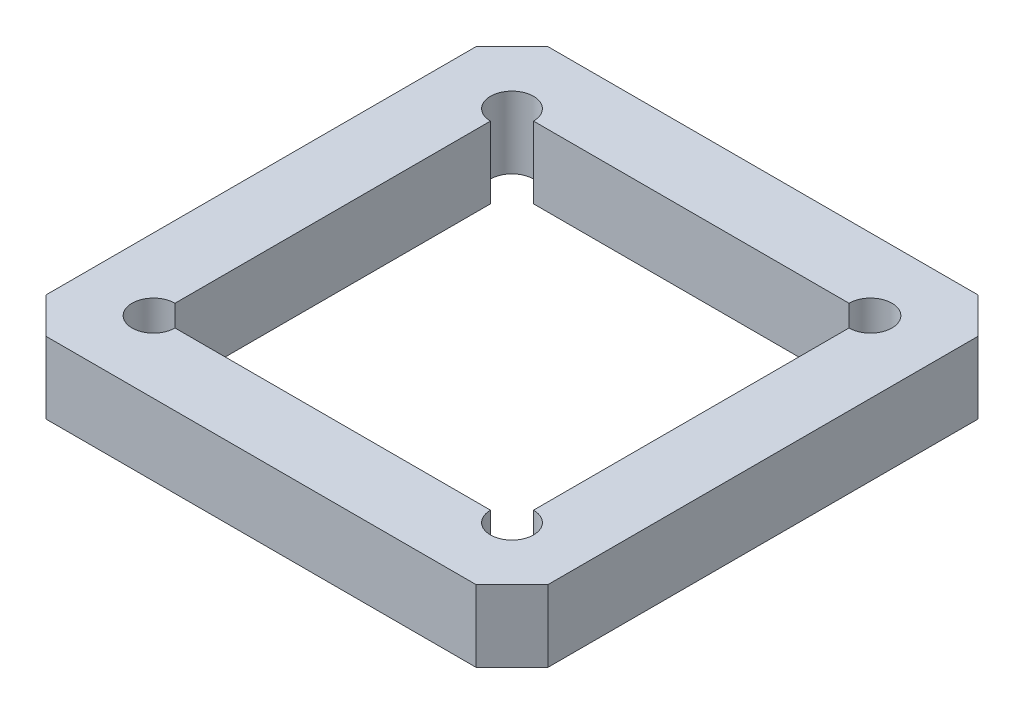
ISO-10303-21;
HEADER;
FILE_DESCRIPTION(('STEP AP214'),'2;1');
FILE_NAME('part.step','',(''),(''),'','','');
FILE_SCHEMA(('AUTOMOTIVE_DESIGN { 1 0 10303 214 1 1 1 1 }'));
ENDSEC;
DATA;
#1=APPLICATION_CONTEXT('core data for automotive mechanical design processes');
#2=APPLICATION_PROTOCOL_DEFINITION('international standard','automotive_design',2000,#1);
#3=PRODUCT_CONTEXT('',#1,'mechanical');
#4=PRODUCT('Part','Part','',(#3));
#5=PRODUCT_RELATED_PRODUCT_CATEGORY('part','',(#4));
#6=PRODUCT_DEFINITION_FORMATION('','',#4);
#7=PRODUCT_DEFINITION_CONTEXT('part definition',#1,'design');
#8=PRODUCT_DEFINITION('design','',#6,#7);
#9=PRODUCT_DEFINITION_SHAPE('','',#8);
#10=(LENGTH_UNIT() NAMED_UNIT(*) SI_UNIT(.MILLI.,.METRE.));
#11=(NAMED_UNIT(*) PLANE_ANGLE_UNIT() SI_UNIT($,.RADIAN.));
#12=(NAMED_UNIT(*) SI_UNIT($,.STERADIAN.) SOLID_ANGLE_UNIT());
#13=UNCERTAINTY_MEASURE_WITH_UNIT(LENGTH_MEASURE(1.E-05),#10,'distance_accuracy_value','');
#14=(GEOMETRIC_REPRESENTATION_CONTEXT(3) GLOBAL_UNCERTAINTY_ASSIGNED_CONTEXT((#13)) GLOBAL_UNIT_ASSIGNED_CONTEXT((#10,
#11,#12)) REPRESENTATION_CONTEXT('',''));
#15=CARTESIAN_POINT('',(0.,0.,0.));
#16=DIRECTION('',(0.,0.,1.));
#17=DIRECTION('',(1.,0.,0.));
#18=AXIS2_PLACEMENT_3D('',#15,#16,#17);
#19=CARTESIAN_POINT('',(-31.1092150170648,10.,-31.1092150170642));
#20=DIRECTION('',(0.707106781186554,0.,0.707106781186541));
#21=DIRECTION('',(0.707106781186541,0.,-0.707106781186554));
#22=AXIS2_PLACEMENT_3D('',#19,#20,#21);
#23=PLANE('',#22);
#24=DIRECTION('',(-0.707106781186541,0.,0.707106781186554));
#25=VECTOR('',#24,1.);
#26=CARTESIAN_POINT('',(-31.1092150170648,0.,-31.1092150170642));
#27=LINE('',#26,#25);
#28=CARTESIAN_POINT('',(7.78156996587033,0.,-70.));
#29=VERTEX_POINT('',#28);
#30=CARTESIAN_POINT('',(2.78156996587034,0.,-64.9999999999999));
#31=VERTEX_POINT('',#30);
#32=EDGE_CURVE('E214',#29,#31,#27,.T.);
#33=ORIENTED_EDGE('',*,*,#32,.T.);
#34=DIRECTION('',(0.,-1.,0.));
#35=VECTOR('',#34,1.);
#36=CARTESIAN_POINT('',(2.78156996587034,10.,-64.9999999999999));
#37=LINE('',#36,#35);
#38=CARTESIAN_POINT('',(2.78156996587034,10.,-64.9999999999999));
#39=VERTEX_POINT('',#38);
#40=EDGE_CURVE('E11',#39,#31,#37,.T.);
#41=ORIENTED_EDGE('',*,*,#40,.F.);
#42=DIRECTION('',(-0.707106781186541,0.,0.707106781186554));
#43=VECTOR('',#42,1.);
#44=CARTESIAN_POINT('',(-31.1092150170648,10.,-31.1092150170642));
#45=LINE('',#44,#43);
#46=CARTESIAN_POINT('',(7.78156996587033,10.,-70.));
#47=VERTEX_POINT('',#46);
#48=EDGE_CURVE('E307',#47,#39,#45,.T.);
#49=ORIENTED_EDGE('',*,*,#48,.F.);
#50=DIRECTION('',(0.,-1.,0.));
#51=VECTOR('',#50,1.);
#52=CARTESIAN_POINT('',(7.78156996587033,10.,-70.));
#53=LINE('',#52,#51);
#54=EDGE_CURVE('E229',#47,#29,#53,.T.);
#55=ORIENTED_EDGE('',*,*,#54,.T.);
#56=EDGE_LOOP('',(#33,#41,#49,#55));
#57=FACE_BOUND('',#56,.T.);
#58=ADVANCED_FACE('F41',(#57),#23,.F.);
#59=CARTESIAN_POINT('',(2.78156996587034,10.,0.));
#60=DIRECTION('',(1.,0.,0.));
#61=DIRECTION('',(0.,0.,-1.));
#62=AXIS2_PLACEMENT_3D('',#59,#60,#61);
#63=PLANE('',#62);
#64=DIRECTION('',(0.,0.,1.));
#65=VECTOR('',#64,1.);
#66=CARTESIAN_POINT('',(2.78156996587034,0.,0.));
#67=LINE('',#66,#65);
#68=CARTESIAN_POINT('',(2.78156996587034,0.,-5.));
#69=VERTEX_POINT('',#68);
#70=EDGE_CURVE('E217',#31,#69,#67,.T.);
#71=ORIENTED_EDGE('',*,*,#70,.T.);
#72=DIRECTION('',(0.,-1.,0.));
#73=VECTOR('',#72,1.);
#74=CARTESIAN_POINT('',(2.78156996587034,10.,-5.));
#75=LINE('',#74,#73);
#76=CARTESIAN_POINT('',(2.78156996587034,10.,-5.));
#77=VERTEX_POINT('',#76);
#78=EDGE_CURVE('E51',#77,#69,#75,.T.);
#79=ORIENTED_EDGE('',*,*,#78,.F.);
#80=DIRECTION('',(0.,0.,1.));
#81=VECTOR('',#80,1.);
#82=CARTESIAN_POINT('',(2.78156996587034,10.,0.));
#83=LINE('',#82,#81);
#84=EDGE_CURVE('E309',#39,#77,#83,.T.);
#85=ORIENTED_EDGE('',*,*,#84,.F.);
#86=ORIENTED_EDGE('',*,*,#40,.T.);
#87=EDGE_LOOP('',(#71,#79,#85,#86));
#88=FACE_BOUND('',#87,.T.);
#89=ADVANCED_FACE('F341',(#88),#63,.F.);
#90=CARTESIAN_POINT('',(3.89078498293517,10.,-3.89078498293516));
#91=DIRECTION('',(0.707106781186548,0.,-0.707106781186547));
#92=DIRECTION('',(-0.707106781186547,0.,-0.707106781186548));
#93=AXIS2_PLACEMENT_3D('',#90,#91,#92);
#94=PLANE('',#93);
#95=DIRECTION('',(0.707106781186547,0.,0.707106781186548));
#96=VECTOR('',#95,1.);
#97=CARTESIAN_POINT('',(3.89078498293517,0.,-3.89078498293516));
#98=LINE('',#97,#96);
#99=CARTESIAN_POINT('',(7.78156996587042,0.,0.));
#100=VERTEX_POINT('',#99);
#101=EDGE_CURVE('E219',#69,#100,#98,.T.);
#102=ORIENTED_EDGE('',*,*,#101,.T.);
#103=DIRECTION('',(0.,-1.,0.));
#104=VECTOR('',#103,1.);
#105=CARTESIAN_POINT('',(7.78156996587042,10.,0.));
#106=LINE('',#105,#104);
#107=CARTESIAN_POINT('',(7.78156996587042,10.,0.));
#108=VERTEX_POINT('',#107);
#109=EDGE_CURVE('E236',#108,#100,#106,.T.);
#110=ORIENTED_EDGE('',*,*,#109,.F.);
#111=DIRECTION('',(0.707106781186547,0.,0.707106781186548));
#112=VECTOR('',#111,1.);
#113=CARTESIAN_POINT('',(3.89078498293517,10.,-3.89078498293516));
#114=LINE('',#113,#112);
#115=EDGE_CURVE('E311',#77,#108,#114,.T.);
#116=ORIENTED_EDGE('',*,*,#115,.F.);
#117=ORIENTED_EDGE('',*,*,#78,.T.);
#118=EDGE_LOOP('',(#102,#110,#116,#117));
#119=FACE_BOUND('',#118,.T.);
#120=ADVANCED_FACE('F346',(#119),#94,.F.);
#121=CARTESIAN_POINT('',(0.,10.,1.07129186593347E-13));
#122=DIRECTION('',(0.,0.,-1.));
#123=DIRECTION('',(-1.,0.,0.));
#124=AXIS2_PLACEMENT_3D('',#121,#122,#123);
#125=PLANE('',#124);
#126=DIRECTION('',(1.,0.,0.));
#127=VECTOR('',#126,1.);
#128=CARTESIAN_POINT('',(0.,0.,1.07129186593347E-13));
#129=LINE('',#128,#127);
#130=CARTESIAN_POINT('',(67.7815699658702,0.,0.));
#131=VERTEX_POINT('',#130);
#132=EDGE_CURVE('E221',#100,#131,#129,.T.);
#133=ORIENTED_EDGE('',*,*,#132,.T.);
#134=DIRECTION('',(0.,-1.,0.));
#135=VECTOR('',#134,1.);
#136=CARTESIAN_POINT('',(67.7815699658702,10.,0.));
#137=LINE('',#136,#135);
#138=CARTESIAN_POINT('',(67.7815699658702,10.,0.));
#139=VERTEX_POINT('',#138);
#140=EDGE_CURVE('E233',#139,#131,#137,.T.);
#141=ORIENTED_EDGE('',*,*,#140,.F.);
#142=DIRECTION('',(1.,0.,0.));
#143=VECTOR('',#142,1.);
#144=CARTESIAN_POINT('',(0.,10.,1.07129186593347E-13));
#145=LINE('',#144,#143);
#146=EDGE_CURVE('E313',#108,#139,#145,.T.);
#147=ORIENTED_EDGE('',*,*,#146,.F.);
#148=ORIENTED_EDGE('',*,*,#109,.T.);
#149=EDGE_LOOP('',(#133,#141,#147,#148));
#150=FACE_BOUND('',#149,.T.);
#151=ADVANCED_FACE('F319',(#150),#125,.F.);
#152=CARTESIAN_POINT('',(33.8907849829344,10.,33.8907849829351));
#153=DIRECTION('',(-0.707106781186541,0.,-0.707106781186555));
#154=DIRECTION('',(-0.707106781186555,0.,0.707106781186541));
#155=AXIS2_PLACEMENT_3D('',#152,#153,#154);
#156=PLANE('',#155);
#157=DIRECTION('',(0.707106781186555,0.,-0.707106781186541));
#158=VECTOR('',#157,1.);
#159=CARTESIAN_POINT('',(33.8907849829344,0.,33.8907849829351));
#160=LINE('',#159,#158);
#161=CARTESIAN_POINT('',(72.7815699658703,0.,-4.99999999999999));
#162=VERTEX_POINT('',#161);
#163=EDGE_CURVE('E223',#131,#162,#160,.T.);
#164=ORIENTED_EDGE('',*,*,#163,.T.);
#165=DIRECTION('',(0.,-1.,0.));
#166=VECTOR('',#165,1.);
#167=CARTESIAN_POINT('',(72.7815699658703,10.,-4.99999999999999));
#168=LINE('',#167,#166);
#169=CARTESIAN_POINT('',(72.7815699658703,10.,-4.99999999999999));
#170=VERTEX_POINT('',#169);
#171=EDGE_CURVE('E180',#170,#162,#168,.T.);
#172=ORIENTED_EDGE('',*,*,#171,.F.);
#173=DIRECTION('',(0.707106781186555,0.,-0.707106781186541));
#174=VECTOR('',#173,1.);
#175=CARTESIAN_POINT('',(33.8907849829344,10.,33.8907849829351));
#176=LINE('',#175,#174);
#177=EDGE_CURVE('E171',#139,#170,#176,.T.);
#178=ORIENTED_EDGE('',*,*,#177,.F.);
#179=ORIENTED_EDGE('',*,*,#140,.T.);
#180=EDGE_LOOP('',(#164,#172,#178,#179));
#181=FACE_BOUND('',#180,.T.);
#182=ADVANCED_FACE('F323',(#181),#156,.F.);
#183=CARTESIAN_POINT('',(72.7815699658703,10.,0.));
#184=DIRECTION('',(-1.,0.,0.));
#185=DIRECTION('',(0.,0.,1.));
#186=AXIS2_PLACEMENT_3D('',#183,#184,#185);
#187=PLANE('',#186);
#188=DIRECTION('',(0.,0.,-1.));
#189=VECTOR('',#188,1.);
#190=CARTESIAN_POINT('',(72.7815699658703,0.,0.));
#191=LINE('',#190,#189);
#192=CARTESIAN_POINT('',(72.7815699658703,0.,-64.9999999999999));
#193=VERTEX_POINT('',#192);
#194=EDGE_CURVE('E179',#162,#193,#191,.T.);
#195=ORIENTED_EDGE('',*,*,#194,.T.);
#196=DIRECTION('',(0.,-1.,0.));
#197=VECTOR('',#196,1.);
#198=CARTESIAN_POINT('',(72.7815699658703,10.,-64.9999999999999));
#199=LINE('',#198,#197);
#200=CARTESIAN_POINT('',(72.7815699658703,10.,-64.9999999999999));
#201=VERTEX_POINT('',#200);
#202=EDGE_CURVE('E176',#201,#193,#199,.T.);
#203=ORIENTED_EDGE('',*,*,#202,.F.);
#204=DIRECTION('',(0.,0.,-1.));
#205=VECTOR('',#204,1.);
#206=CARTESIAN_POINT('',(72.7815699658703,10.,0.));
#207=LINE('',#206,#205);
#208=EDGE_CURVE('E165',#170,#201,#207,.T.);
#209=ORIENTED_EDGE('',*,*,#208,.F.);
#210=ORIENTED_EDGE('',*,*,#171,.T.);
#211=EDGE_LOOP('',(#195,#203,#209,#210));
#212=FACE_BOUND('',#211,.T.);
#213=ADVANCED_FACE('F177',(#212),#187,.F.);
#214=CARTESIAN_POINT('',(68.8907849829357,10.,-68.8907849829346));
#215=DIRECTION('',(-0.707106781186553,0.,0.707106781186542));
#216=DIRECTION('',(0.707106781186542,0.,0.707106781186553));
#217=AXIS2_PLACEMENT_3D('',#214,#215,#216);
#218=PLANE('',#217);
#219=DIRECTION('',(-0.707106781186542,0.,-0.707106781186553));
#220=VECTOR('',#219,1.);
#221=CARTESIAN_POINT('',(68.8907849829357,0.,-68.8907849829346));
#222=LINE('',#221,#220);
#223=CARTESIAN_POINT('',(67.7815699658703,0.,-70.));
#224=VERTEX_POINT('',#223);
#225=EDGE_CURVE('E113',#193,#224,#222,.T.);
#226=ORIENTED_EDGE('',*,*,#225,.T.);
#227=DIRECTION('',(0.,-1.,0.));
#228=VECTOR('',#227,1.);
#229=CARTESIAN_POINT('',(67.7815699658703,10.,-70.));
#230=LINE('',#229,#228);
#231=CARTESIAN_POINT('',(67.7815699658703,10.,-70.));
#232=VERTEX_POINT('',#231);
#233=EDGE_CURVE('E181',#232,#224,#230,.T.);
#234=ORIENTED_EDGE('',*,*,#233,.F.);
#235=DIRECTION('',(-0.707106781186542,0.,-0.707106781186553));
#236=VECTOR('',#235,1.);
#237=CARTESIAN_POINT('',(68.8907849829357,10.,-68.8907849829346));
#238=LINE('',#237,#236);
#239=EDGE_CURVE('E169',#201,#232,#238,.T.);
#240=ORIENTED_EDGE('',*,*,#239,.F.);
#241=ORIENTED_EDGE('',*,*,#202,.T.);
#242=EDGE_LOOP('',(#226,#234,#240,#241));
#243=FACE_BOUND('',#242,.T.);
#244=ADVANCED_FACE('F183',(#243),#218,.F.);
#245=CARTESIAN_POINT('',(12.7815699658703,10.,-59.9999999999999));
#246=DIRECTION('',(0.,-1.,0.));
#247=DIRECTION('',(0.,0.,-1.));
#248=AXIS2_PLACEMENT_3D('',#245,#246,#247);
#249=CYLINDRICAL_SURFACE('',#248,3.);
#250=CARTESIAN_POINT('',(12.7815699658703,0.,-59.9999999999999));
#251=DIRECTION('',(0.,1.,0.));
#252=DIRECTION('',(0.,0.,1.));
#253=AXIS2_PLACEMENT_3D('',#250,#251,#252);
#254=CIRCLE('',#253,3.);
#255=CARTESIAN_POINT('',(15.7815699658703,0.,-59.9999999999999));
#256=VERTEX_POINT('',#255);
#257=CARTESIAN_POINT('',(12.7815699658703,0.,-56.9999999999999));
#258=VERTEX_POINT('',#257);
#259=EDGE_CURVE('E189',#256,#258,#254,.T.);
#260=ORIENTED_EDGE('',*,*,#259,.F.);
#261=DIRECTION('',(0.,-1.,0.));
#262=VECTOR('',#261,1.);
#263=CARTESIAN_POINT('',(15.7815699658703,10.,-59.9999999999999));
#264=LINE('',#263,#262);
#265=CARTESIAN_POINT('',(15.7815699658703,10.,-59.9999999999999));
#266=VERTEX_POINT('',#265);
#267=EDGE_CURVE('E45',#266,#256,#264,.T.);
#268=ORIENTED_EDGE('',*,*,#267,.F.);
#269=CARTESIAN_POINT('',(12.7815699658703,10.,-59.9999999999999));
#270=DIRECTION('',(0.,1.,0.));
#271=DIRECTION('',(0.,0.,1.));
#272=AXIS2_PLACEMENT_3D('',#269,#270,#271);
#273=CIRCLE('',#272,3.);
#274=CARTESIAN_POINT('',(12.7815699658703,10.,-56.9999999999999));
#275=VERTEX_POINT('',#274);
#276=EDGE_CURVE('E228',#266,#275,#273,.T.);
#277=ORIENTED_EDGE('',*,*,#276,.T.);
#278=DIRECTION('',(0.,-1.,0.));
#279=VECTOR('',#278,1.);
#280=CARTESIAN_POINT('',(12.7815699658703,10.,-56.9999999999999));
#281=LINE('',#280,#279);
#282=EDGE_CURVE('E185',#275,#258,#281,.T.);
#283=ORIENTED_EDGE('',*,*,#282,.T.);
#284=EDGE_LOOP('',(#260,#268,#277,#283));
#285=FACE_BOUND('',#284,.T.);
#286=ADVANCED_FACE('F43',(#285),#249,.F.);
#287=CARTESIAN_POINT('',(0.,10.,-59.9999999999999));
#288=DIRECTION('',(0.,0.,-1.));
#289=DIRECTION('',(-1.,0.,0.));
#290=AXIS2_PLACEMENT_3D('',#287,#288,#289);
#291=PLANE('',#290);
#292=DIRECTION('',(1.,0.,0.));
#293=VECTOR('',#292,1.);
#294=CARTESIAN_POINT('',(0.,0.,-59.9999999999999));
#295=LINE('',#294,#293);
#296=CARTESIAN_POINT('',(59.7815699658703,0.,-59.9999999999999));
#297=VERTEX_POINT('',#296);
#298=EDGE_CURVE('E192',#256,#297,#295,.T.);
#299=ORIENTED_EDGE('',*,*,#298,.T.);
#300=DIRECTION('',(0.,-1.,0.));
#301=VECTOR('',#300,1.);
#302=CARTESIAN_POINT('',(59.7815699658703,10.,-59.9999999999999));
#303=LINE('',#302,#301);
#304=CARTESIAN_POINT('',(59.7815699658703,10.,-59.9999999999999));
#305=VERTEX_POINT('',#304);
#306=EDGE_CURVE('E251',#305,#297,#303,.T.);
#307=ORIENTED_EDGE('',*,*,#306,.F.);
#308=DIRECTION('',(1.,0.,0.));
#309=VECTOR('',#308,1.);
#310=CARTESIAN_POINT('',(0.,10.,-59.9999999999999));
#311=LINE('',#310,#309);
#312=EDGE_CURVE('E259',#266,#305,#311,.T.);
#313=ORIENTED_EDGE('',*,*,#312,.F.);
#314=ORIENTED_EDGE('',*,*,#267,.T.);
#315=EDGE_LOOP('',(#299,#307,#313,#314));
#316=FACE_BOUND('',#315,.T.);
#317=ADVANCED_FACE('F258',(#316),#291,.F.);
#318=CARTESIAN_POINT('',(62.7815699658703,10.,-59.9999999999999));
#319=DIRECTION('',(0.,-1.,0.));
#320=DIRECTION('',(0.,0.,-1.));
#321=AXIS2_PLACEMENT_3D('',#318,#319,#320);
#322=CYLINDRICAL_SURFACE('',#321,3.00000000000001);
#323=CARTESIAN_POINT('',(62.7815699658703,0.,-59.9999999999999));
#324=DIRECTION('',(0.,1.,0.));
#325=DIRECTION('',(0.,0.,1.));
#326=AXIS2_PLACEMENT_3D('',#323,#324,#325);
#327=CIRCLE('',#326,3.00000000000001);
#328=CARTESIAN_POINT('',(62.7815699658703,0.,-56.9999999999999));
#329=VERTEX_POINT('',#328);
#330=EDGE_CURVE('E196',#329,#297,#327,.T.);
#331=ORIENTED_EDGE('',*,*,#330,.F.);
#332=DIRECTION('',(0.,-1.,0.));
#333=VECTOR('',#332,1.);
#334=CARTESIAN_POINT('',(62.7815699658703,10.,-56.9999999999999));
#335=LINE('',#334,#333);
#336=CARTESIAN_POINT('',(62.7815699658703,10.,-56.9999999999999));
#337=VERTEX_POINT('',#336);
#338=EDGE_CURVE('E250',#337,#329,#335,.T.);
#339=ORIENTED_EDGE('',*,*,#338,.F.);
#340=CARTESIAN_POINT('',(62.7815699658703,10.,-59.9999999999999));
#341=DIRECTION('',(0.,1.,0.));
#342=DIRECTION('',(0.,0.,1.));
#343=AXIS2_PLACEMENT_3D('',#340,#341,#342);
#344=CIRCLE('',#343,3.00000000000001);
#345=EDGE_CURVE('E293',#337,#305,#344,.T.);
#346=ORIENTED_EDGE('',*,*,#345,.T.);
#347=ORIENTED_EDGE('',*,*,#306,.T.);
#348=EDGE_LOOP('',(#331,#339,#346,#347));
#349=FACE_BOUND('',#348,.T.);
#350=ADVANCED_FACE('F290',(#349),#322,.F.);
#351=CARTESIAN_POINT('',(62.7815699658703,10.,0.));
#352=DIRECTION('',(1.,0.,0.));
#353=DIRECTION('',(0.,0.,-1.));
#354=AXIS2_PLACEMENT_3D('',#351,#352,#353);
#355=PLANE('',#354);
#356=DIRECTION('',(0.,0.,1.));
#357=VECTOR('',#356,1.);
#358=CARTESIAN_POINT('',(62.7815699658703,0.,0.));
#359=LINE('',#358,#357);
#360=CARTESIAN_POINT('',(62.7815699658703,0.,-13.));
#361=VERTEX_POINT('',#360);
#362=EDGE_CURVE('E199',#329,#361,#359,.T.);
#363=ORIENTED_EDGE('',*,*,#362,.T.);
#364=DIRECTION('',(0.,-1.,0.));
#365=VECTOR('',#364,1.);
#366=CARTESIAN_POINT('',(62.7815699658703,10.,-13.));
#367=LINE('',#366,#365);
#368=CARTESIAN_POINT('',(62.7815699658703,10.,-13.));
#369=VERTEX_POINT('',#368);
#370=EDGE_CURVE('E248',#369,#361,#367,.T.);
#371=ORIENTED_EDGE('',*,*,#370,.F.);
#372=DIRECTION('',(0.,0.,1.));
#373=VECTOR('',#372,1.);
#374=CARTESIAN_POINT('',(62.7815699658703,10.,0.));
#375=LINE('',#374,#373);
#376=EDGE_CURVE('E294',#337,#369,#375,.T.);
#377=ORIENTED_EDGE('',*,*,#376,.F.);
#378=ORIENTED_EDGE('',*,*,#338,.T.);
#379=EDGE_LOOP('',(#363,#371,#377,#378));
#380=FACE_BOUND('',#379,.T.);
#381=ADVANCED_FACE('F295',(#380),#355,.F.);
#382=CARTESIAN_POINT('',(62.7815699658703,10.,-10.));
#383=DIRECTION('',(0.,-1.,0.));
#384=DIRECTION('',(0.,0.,-1.));
#385=AXIS2_PLACEMENT_3D('',#382,#383,#384);
#386=CYLINDRICAL_SURFACE('',#385,3.00000000000001);
#387=CARTESIAN_POINT('',(62.7815699658703,0.,-10.));
#388=DIRECTION('',(0.,1.,0.));
#389=DIRECTION('',(0.,0.,1.));
#390=AXIS2_PLACEMENT_3D('',#387,#388,#389);
#391=CIRCLE('',#390,3.00000000000001);
#392=CARTESIAN_POINT('',(59.7815699658703,0.,-10.));
#393=VERTEX_POINT('',#392);
#394=EDGE_CURVE('E202',#393,#361,#391,.T.);
#395=ORIENTED_EDGE('',*,*,#394,.F.);
#396=DIRECTION('',(0.,-1.,0.));
#397=VECTOR('',#396,1.);
#398=CARTESIAN_POINT('',(59.7815699658703,10.,-10.));
#399=LINE('',#398,#397);
#400=CARTESIAN_POINT('',(59.7815699658703,10.,-10.));
#401=VERTEX_POINT('',#400);
#402=EDGE_CURVE('E246',#401,#393,#399,.T.);
#403=ORIENTED_EDGE('',*,*,#402,.F.);
#404=CARTESIAN_POINT('',(62.7815699658703,10.,-10.));
#405=DIRECTION('',(0.,1.,0.));
#406=DIRECTION('',(0.,0.,1.));
#407=AXIS2_PLACEMENT_3D('',#404,#405,#406);
#408=CIRCLE('',#407,3.00000000000001);
#409=EDGE_CURVE('E297',#401,#369,#408,.T.);
#410=ORIENTED_EDGE('',*,*,#409,.T.);
#411=ORIENTED_EDGE('',*,*,#370,.T.);
#412=EDGE_LOOP('',(#395,#403,#410,#411));
#413=FACE_BOUND('',#412,.T.);
#414=ADVANCED_FACE('F287',(#413),#386,.F.);
#415=CARTESIAN_POINT('',(0.,10.,-10.));
#416=DIRECTION('',(0.,0.,-1.));
#417=DIRECTION('',(-1.,0.,0.));
#418=AXIS2_PLACEMENT_3D('',#415,#416,#417);
#419=PLANE('',#418);
#420=DIRECTION('',(1.,0.,0.));
#421=VECTOR('',#420,1.);
#422=CARTESIAN_POINT('',(0.,0.,-10.));
#423=LINE('',#422,#421);
#424=CARTESIAN_POINT('',(15.7815699658703,0.,-10.));
#425=VERTEX_POINT('',#424);
#426=EDGE_CURVE('E205',#425,#393,#423,.T.);
#427=ORIENTED_EDGE('',*,*,#426,.F.);
#428=DIRECTION('',(0.,-1.,0.));
#429=VECTOR('',#428,1.);
#430=CARTESIAN_POINT('',(15.7815699658703,10.,-10.));
#431=LINE('',#430,#429);
#432=CARTESIAN_POINT('',(15.7815699658703,10.,-10.));
#433=VERTEX_POINT('',#432);
#434=EDGE_CURVE('E244',#433,#425,#431,.T.);
#435=ORIENTED_EDGE('',*,*,#434,.F.);
#436=DIRECTION('',(1.,0.,0.));
#437=VECTOR('',#436,1.);
#438=CARTESIAN_POINT('',(0.,10.,-10.));
#439=LINE('',#438,#437);
#440=EDGE_CURVE('E283',#433,#401,#439,.T.);
#441=ORIENTED_EDGE('',*,*,#440,.T.);
#442=ORIENTED_EDGE('',*,*,#402,.T.);
#443=EDGE_LOOP('',(#427,#435,#441,#442));
#444=FACE_BOUND('',#443,.T.);
#445=ADVANCED_FACE('F281',(#444),#419,.T.);
#446=CARTESIAN_POINT('',(12.7815699658703,10.,-10.));
#447=DIRECTION('',(0.,-1.,0.));
#448=DIRECTION('',(0.,0.,-1.));
#449=AXIS2_PLACEMENT_3D('',#446,#447,#448);
#450=CYLINDRICAL_SURFACE('',#449,3.);
#451=CARTESIAN_POINT('',(12.7815699658703,0.,-10.));
#452=DIRECTION('',(0.,1.,0.));
#453=DIRECTION('',(0.,0.,1.));
#454=AXIS2_PLACEMENT_3D('',#451,#452,#453);
#455=CIRCLE('',#454,3.);
#456=CARTESIAN_POINT('',(12.7815699658703,0.,-13.));
#457=VERTEX_POINT('',#456);
#458=EDGE_CURVE('E208',#457,#425,#455,.T.);
#459=ORIENTED_EDGE('',*,*,#458,.F.);
#460=DIRECTION('',(0.,-1.,0.));
#461=VECTOR('',#460,1.);
#462=CARTESIAN_POINT('',(12.7815699658703,10.,-13.));
#463=LINE('',#462,#461);
#464=CARTESIAN_POINT('',(12.7815699658703,10.,-13.));
#465=VERTEX_POINT('',#464);
#466=EDGE_CURVE('E242',#465,#457,#463,.T.);
#467=ORIENTED_EDGE('',*,*,#466,.F.);
#468=CARTESIAN_POINT('',(12.7815699658703,10.,-10.));
#469=DIRECTION('',(0.,1.,0.));
#470=DIRECTION('',(0.,0.,1.));
#471=AXIS2_PLACEMENT_3D('',#468,#469,#470);
#472=CIRCLE('',#471,3.);
#473=EDGE_CURVE('E277',#465,#433,#472,.T.);
#474=ORIENTED_EDGE('',*,*,#473,.T.);
#475=ORIENTED_EDGE('',*,*,#434,.T.);
#476=EDGE_LOOP('',(#459,#467,#474,#475));
#477=FACE_BOUND('',#476,.T.);
#478=ADVANCED_FACE('F274',(#477),#450,.F.);
#479=CARTESIAN_POINT('',(12.7815699658703,10.,0.));
#480=DIRECTION('',(1.,0.,0.));
#481=DIRECTION('',(0.,0.,-1.));
#482=AXIS2_PLACEMENT_3D('',#479,#480,#481);
#483=PLANE('',#482);
#484=DIRECTION('',(0.,0.,1.));
#485=VECTOR('',#484,1.);
#486=CARTESIAN_POINT('',(12.7815699658703,0.,0.));
#487=LINE('',#486,#485);
#488=EDGE_CURVE('E211',#258,#457,#487,.T.);
#489=ORIENTED_EDGE('',*,*,#488,.F.);
#490=ORIENTED_EDGE('',*,*,#282,.F.);
#491=DIRECTION('',(0.,0.,1.));
#492=VECTOR('',#491,1.);
#493=CARTESIAN_POINT('',(12.7815699658703,10.,0.));
#494=LINE('',#493,#492);
#495=EDGE_CURVE('E270',#275,#465,#494,.T.);
#496=ORIENTED_EDGE('',*,*,#495,.T.);
#497=ORIENTED_EDGE('',*,*,#466,.T.);
#498=EDGE_LOOP('',(#489,#490,#496,#497));
#499=FACE_BOUND('',#498,.T.);
#500=ADVANCED_FACE('F269',(#499),#483,.T.);
#501=CARTESIAN_POINT('',(0.,10.,-70.));
#502=DIRECTION('',(0.,0.,1.));
#503=DIRECTION('',(1.,0.,0.));
#504=AXIS2_PLACEMENT_3D('',#501,#502,#503);
#505=PLANE('',#504);
#506=DIRECTION('',(-1.,0.,0.));
#507=VECTOR('',#506,1.);
#508=CARTESIAN_POINT('',(0.,0.,-70.));
#509=LINE('',#508,#507);
#510=EDGE_CURVE('E119',#224,#29,#509,.T.);
#511=ORIENTED_EDGE('',*,*,#510,.T.);
#512=ORIENTED_EDGE('',*,*,#54,.F.);
#513=DIRECTION('',(-1.,0.,0.));
#514=VECTOR('',#513,1.);
#515=CARTESIAN_POINT('',(0.,10.,-70.));
#516=LINE('',#515,#514);
#517=EDGE_CURVE('E60',#232,#47,#516,.T.);
#518=ORIENTED_EDGE('',*,*,#517,.F.);
#519=ORIENTED_EDGE('',*,*,#233,.T.);
#520=EDGE_LOOP('',(#511,#512,#518,#519));
#521=FACE_BOUND('',#520,.T.);
#522=ADVANCED_FACE('F329',(#521),#505,.F.);
#523=CARTESIAN_POINT('',(0.,10.,0.));
#524=DIRECTION('',(0.,1.,0.));
#525=DIRECTION('',(0.,0.,1.));
#526=AXIS2_PLACEMENT_3D('',#523,#524,#525);
#527=PLANE('',#526);
#528=ORIENTED_EDGE('',*,*,#276,.F.);
#529=ORIENTED_EDGE('',*,*,#312,.T.);
#530=ORIENTED_EDGE('',*,*,#345,.F.);
#531=ORIENTED_EDGE('',*,*,#376,.T.);
#532=ORIENTED_EDGE('',*,*,#409,.F.);
#533=ORIENTED_EDGE('',*,*,#440,.F.);
#534=ORIENTED_EDGE('',*,*,#473,.F.);
#535=ORIENTED_EDGE('',*,*,#495,.F.);
#536=EDGE_LOOP('',(#528,#529,#530,#531,#532,#533,#534,#535));
#537=FACE_BOUND('',#536,.T.);
#538=ORIENTED_EDGE('',*,*,#48,.T.);
#539=ORIENTED_EDGE('',*,*,#84,.T.);
#540=ORIENTED_EDGE('',*,*,#115,.T.);
#541=ORIENTED_EDGE('',*,*,#146,.T.);
#542=ORIENTED_EDGE('',*,*,#177,.T.);
#543=ORIENTED_EDGE('',*,*,#208,.T.);
#544=ORIENTED_EDGE('',*,*,#239,.T.);
#545=ORIENTED_EDGE('',*,*,#517,.T.);
#546=EDGE_LOOP('',(#538,#539,#540,#541,#542,#543,#544,#545));
#547=FACE_BOUND('',#546,.T.);
#548=ADVANCED_FACE('F167',(#537,#547),#527,.T.);
#549=CARTESIAN_POINT('',(0.,0.,0.));
#550=DIRECTION('',(0.,1.,0.));
#551=DIRECTION('',(0.,0.,1.));
#552=AXIS2_PLACEMENT_3D('',#549,#550,#551);
#553=PLANE('',#552);
#554=CARTESIAN_POINT('',(7.83182249756459,0.,-19.9999999999999));
#555=DIRECTION('',(0.,-1.,0.));
#556=DIRECTION('',(0.,0.,-1.));
#557=AXIS2_PLACEMENT_3D('',#554,#555,#556);
#558=CIRCLE('',#557,4.);
#559=CARTESIAN_POINT('',(7.83182249756459,0.,-23.9999999999999));
#560=VERTEX_POINT('',#559);
#561=EDGE_CURVE('E709',#560,#560,#558,.T.);
#562=ORIENTED_EDGE('',*,*,#561,.F.);
#563=EDGE_LOOP('',(#562));
#564=FACE_BOUND('',#563,.T.);
#565=CARTESIAN_POINT('',(7.83182249756459,0.,-50.));
#566=DIRECTION('',(0.,-1.,0.));
#567=DIRECTION('',(0.,0.,-1.));
#568=AXIS2_PLACEMENT_3D('',#565,#566,#567);
#569=CIRCLE('',#568,4.);
#570=CARTESIAN_POINT('',(7.83182249756459,0.,-54.));
#571=VERTEX_POINT('',#570);
#572=EDGE_CURVE('E755',#571,#571,#569,.T.);
#573=ORIENTED_EDGE('',*,*,#572,.F.);
#574=EDGE_LOOP('',(#573));
#575=FACE_BOUND('',#574,.T.);
#576=CARTESIAN_POINT('',(22.7815699658703,0.,-64.8994949366114));
#577=DIRECTION('',(0.,-1.,0.));
#578=DIRECTION('',(0.,0.,-1.));
#579=AXIS2_PLACEMENT_3D('',#576,#577,#578);
#580=CIRCLE('',#579,4.);
#581=CARTESIAN_POINT('',(22.7815699658703,0.,-68.8994949366114));
#582=VERTEX_POINT('',#581);
#583=EDGE_CURVE('E749',#582,#582,#580,.T.);
#584=ORIENTED_EDGE('',*,*,#583,.F.);
#585=EDGE_LOOP('',(#584));
#586=FACE_BOUND('',#585,.T.);
#587=CARTESIAN_POINT('',(52.6810649024818,0.,-64.8994949366114));
#588=DIRECTION('',(0.,-1.,0.));
#589=DIRECTION('',(0.,0.,-1.));
#590=AXIS2_PLACEMENT_3D('',#587,#588,#589);
#591=CIRCLE('',#590,4.00000000000001);
#592=CARTESIAN_POINT('',(52.6810649024818,0.,-68.8994949366114));
#593=VERTEX_POINT('',#592);
#594=EDGE_CURVE('E743',#593,#593,#591,.T.);
#595=ORIENTED_EDGE('',*,*,#594,.F.);
#596=EDGE_LOOP('',(#595));
#597=FACE_BOUND('',#596,.T.);
#598=CARTESIAN_POINT('',(67.7815699658703,0.,-50.));
#599=DIRECTION('',(0.,-1.,0.));
#600=DIRECTION('',(0.,0.,-1.));
#601=AXIS2_PLACEMENT_3D('',#598,#599,#600);
#602=CIRCLE('',#601,4.00000000000001);
#603=CARTESIAN_POINT('',(67.7815699658703,0.,-54.));
#604=VERTEX_POINT('',#603);
#605=EDGE_CURVE('E737',#604,#604,#602,.T.);
#606=ORIENTED_EDGE('',*,*,#605,.F.);
#607=EDGE_LOOP('',(#606));
#608=FACE_BOUND('',#607,.T.);
#609=CARTESIAN_POINT('',(67.7815699658703,0.,-19.9999999999998));
#610=DIRECTION('',(0.,-1.,0.));
#611=DIRECTION('',(0.,0.,-1.));
#612=AXIS2_PLACEMENT_3D('',#609,#610,#611);
#613=CIRCLE('',#612,4.00000000000001);
#614=CARTESIAN_POINT('',(67.7815699658703,0.,-23.9999999999998));
#615=VERTEX_POINT('',#614);
#616=EDGE_CURVE('E729',#615,#615,#613,.T.);
#617=ORIENTED_EDGE('',*,*,#616,.F.);
#618=EDGE_LOOP('',(#617));
#619=FACE_BOUND('',#618,.T.);
#620=CARTESIAN_POINT('',(52.6810649024818,0.,-4.99999999999988));
#621=DIRECTION('',(0.,-1.,0.));
#622=DIRECTION('',(0.,0.,-1.));
#623=AXIS2_PLACEMENT_3D('',#620,#621,#622);
#624=CIRCLE('',#623,4.00000000000001);
#625=CARTESIAN_POINT('',(52.6810649024818,0.,-8.99999999999989));
#626=VERTEX_POINT('',#625);
#627=EDGE_CURVE('E720',#626,#626,#624,.T.);
#628=ORIENTED_EDGE('',*,*,#627,.F.);
#629=EDGE_LOOP('',(#628));
#630=FACE_BOUND('',#629,.T.);
#631=CARTESIAN_POINT('',(22.7815699658703,0.,-4.99999999999988));
#632=DIRECTION('',(0.,-1.,0.));
#633=DIRECTION('',(0.,0.,-1.));
#634=AXIS2_PLACEMENT_3D('',#631,#632,#633);
#635=CIRCLE('',#634,4.);
#636=CARTESIAN_POINT('',(22.7815699658703,0.,-8.99999999999988));
#637=VERTEX_POINT('',#636);
#638=EDGE_CURVE('E718',#637,#637,#635,.T.);
#639=ORIENTED_EDGE('',*,*,#638,.F.);
#640=EDGE_LOOP('',(#639));
#641=FACE_BOUND('',#640,.T.);
#642=ORIENTED_EDGE('',*,*,#259,.T.);
#643=ORIENTED_EDGE('',*,*,#488,.T.);
#644=ORIENTED_EDGE('',*,*,#458,.T.);
#645=ORIENTED_EDGE('',*,*,#426,.T.);
#646=ORIENTED_EDGE('',*,*,#394,.T.);
#647=ORIENTED_EDGE('',*,*,#362,.F.);
#648=ORIENTED_EDGE('',*,*,#330,.T.);
#649=ORIENTED_EDGE('',*,*,#298,.F.);
#650=EDGE_LOOP('',(#642,#643,#644,#645,#646,#647,#648,#649));
#651=FACE_BOUND('',#650,.T.);
#652=ORIENTED_EDGE('',*,*,#32,.F.);
#653=ORIENTED_EDGE('',*,*,#510,.F.);
#654=ORIENTED_EDGE('',*,*,#225,.F.);
#655=ORIENTED_EDGE('',*,*,#194,.F.);
#656=ORIENTED_EDGE('',*,*,#163,.F.);
#657=ORIENTED_EDGE('',*,*,#132,.F.);
#658=ORIENTED_EDGE('',*,*,#101,.F.);
#659=ORIENTED_EDGE('',*,*,#70,.F.);
#660=EDGE_LOOP('',(#652,#653,#654,#655,#656,#657,#658,#659));
#661=FACE_BOUND('',#660,.T.);
#662=ADVANCED_FACE('F262',(#564,#575,#586,#597,#608,#619,#630,#641,#651,#661),#553,.F.);
#663=CARTESIAN_POINT('',(22.7815699658703,5.,-4.99999999999988));
#664=DIRECTION('',(0.,-1.,0.));
#665=DIRECTION('',(0.,0.,-1.));
#666=AXIS2_PLACEMENT_3D('',#663,#664,#665);
#667=CYLINDRICAL_SURFACE('',#666,4.);
#668=CARTESIAN_POINT('',(22.7815699658703,5.,-4.99999999999988));
#669=DIRECTION('',(0.,-1.,0.));
#670=DIRECTION('',(0.,0.,-1.));
#671=AXIS2_PLACEMENT_3D('',#668,#669,#670);
#672=CIRCLE('',#671,4.);
#673=CARTESIAN_POINT('',(22.7815699658703,5.,-8.99999999999988));
#674=VERTEX_POINT('',#673);
#675=EDGE_CURVE('E193',#674,#674,#672,.T.);
#676=ORIENTED_EDGE('',*,*,#675,.F.);
#677=EDGE_LOOP('',(#676));
#678=FACE_BOUND('',#677,.T.);
#679=ORIENTED_EDGE('',*,*,#638,.T.);
#680=EDGE_LOOP('',(#679));
#681=FACE_BOUND('',#680,.T.);
#682=ADVANCED_FACE('F473',(#678,#681),#667,.F.);
#683=CARTESIAN_POINT('',(22.7815699658703,5.,-4.99999999999988));
#684=DIRECTION('',(0.,-1.,0.));
#685=DIRECTION('',(0.,0.,-1.));
#686=AXIS2_PLACEMENT_3D('',#683,#684,#685);
#687=PLANE('',#686);
#688=ORIENTED_EDGE('',*,*,#675,.T.);
#689=EDGE_LOOP('',(#688));
#690=FACE_BOUND('',#689,.T.);
#691=ADVANCED_FACE('F483',(#690),#687,.T.);
#692=CARTESIAN_POINT('',(52.6810649024818,5.,-4.99999999999988));
#693=DIRECTION('',(0.,-1.,0.));
#694=DIRECTION('',(0.,0.,-1.));
#695=AXIS2_PLACEMENT_3D('',#692,#693,#694);
#696=CYLINDRICAL_SURFACE('',#695,4.00000000000001);
#697=CARTESIAN_POINT('',(52.6810649024818,5.,-4.99999999999988));
#698=DIRECTION('',(0.,-1.,0.));
#699=DIRECTION('',(0.,0.,-1.));
#700=AXIS2_PLACEMENT_3D('',#697,#698,#699);
#701=CIRCLE('',#700,4.00000000000001);
#702=CARTESIAN_POINT('',(52.6810649024818,5.,-8.99999999999989));
#703=VERTEX_POINT('',#702);
#704=EDGE_CURVE('E724',#703,#703,#701,.T.);
#705=ORIENTED_EDGE('',*,*,#704,.F.);
#706=EDGE_LOOP('',(#705));
#707=FACE_BOUND('',#706,.T.);
#708=ORIENTED_EDGE('',*,*,#627,.T.);
#709=EDGE_LOOP('',(#708));
#710=FACE_BOUND('',#709,.T.);
#711=ADVANCED_FACE('F494',(#707,#710),#696,.F.);
#712=CARTESIAN_POINT('',(52.6810649024818,5.,-4.99999999999988));
#713=DIRECTION('',(0.,-1.,0.));
#714=DIRECTION('',(0.,0.,-1.));
#715=AXIS2_PLACEMENT_3D('',#712,#713,#714);
#716=PLANE('',#715);
#717=ORIENTED_EDGE('',*,*,#704,.T.);
#718=EDGE_LOOP('',(#717));
#719=FACE_BOUND('',#718,.T.);
#720=ADVANCED_FACE('F505',(#719),#716,.T.);
#721=CARTESIAN_POINT('',(67.7815699658703,5.,-19.9999999999998));
#722=DIRECTION('',(0.,-1.,0.));
#723=DIRECTION('',(0.,0.,-1.));
#724=AXIS2_PLACEMENT_3D('',#721,#722,#723);
#725=CYLINDRICAL_SURFACE('',#724,4.00000000000001);
#726=CARTESIAN_POINT('',(67.7815699658703,5.,-19.9999999999998));
#727=DIRECTION('',(0.,-1.,0.));
#728=DIRECTION('',(0.,0.,-1.));
#729=AXIS2_PLACEMENT_3D('',#726,#727,#728);
#730=CIRCLE('',#729,4.00000000000001);
#731=CARTESIAN_POINT('',(67.7815699658703,5.,-23.9999999999998));
#732=VERTEX_POINT('',#731);
#733=EDGE_CURVE('E734',#732,#732,#730,.T.);
#734=ORIENTED_EDGE('',*,*,#733,.F.);
#735=EDGE_LOOP('',(#734));
#736=FACE_BOUND('',#735,.T.);
#737=ORIENTED_EDGE('',*,*,#616,.T.);
#738=EDGE_LOOP('',(#737));
#739=FACE_BOUND('',#738,.T.);
#740=ADVANCED_FACE('F516',(#736,#739),#725,.F.);
#741=CARTESIAN_POINT('',(67.7815699658703,5.,-19.9999999999998));
#742=DIRECTION('',(0.,-1.,0.));
#743=DIRECTION('',(0.,0.,-1.));
#744=AXIS2_PLACEMENT_3D('',#741,#742,#743);
#745=PLANE('',#744);
#746=ORIENTED_EDGE('',*,*,#733,.T.);
#747=EDGE_LOOP('',(#746));
#748=FACE_BOUND('',#747,.T.);
#749=ADVANCED_FACE('F527',(#748),#745,.T.);
#750=CARTESIAN_POINT('',(67.7815699658703,5.,-50.));
#751=DIRECTION('',(0.,-1.,0.));
#752=DIRECTION('',(0.,0.,-1.));
#753=AXIS2_PLACEMENT_3D('',#750,#751,#752);
#754=CYLINDRICAL_SURFACE('',#753,4.00000000000001);
#755=CARTESIAN_POINT('',(67.7815699658703,5.,-50.));
#756=DIRECTION('',(0.,-1.,0.));
#757=DIRECTION('',(0.,0.,-1.));
#758=AXIS2_PLACEMENT_3D('',#755,#756,#757);
#759=CIRCLE('',#758,4.00000000000001);
#760=CARTESIAN_POINT('',(67.7815699658703,5.,-54.));
#761=VERTEX_POINT('',#760);
#762=EDGE_CURVE('E740',#761,#761,#759,.T.);
#763=ORIENTED_EDGE('',*,*,#762,.F.);
#764=EDGE_LOOP('',(#763));
#765=FACE_BOUND('',#764,.T.);
#766=ORIENTED_EDGE('',*,*,#605,.T.);
#767=EDGE_LOOP('',(#766));
#768=FACE_BOUND('',#767,.T.);
#769=ADVANCED_FACE('F538',(#765,#768),#754,.F.);
#770=CARTESIAN_POINT('',(67.7815699658703,5.,-50.));
#771=DIRECTION('',(0.,-1.,0.));
#772=DIRECTION('',(0.,0.,-1.));
#773=AXIS2_PLACEMENT_3D('',#770,#771,#772);
#774=PLANE('',#773);
#775=ORIENTED_EDGE('',*,*,#762,.T.);
#776=EDGE_LOOP('',(#775));
#777=FACE_BOUND('',#776,.T.);
#778=ADVANCED_FACE('F549',(#777),#774,.T.);
#779=CARTESIAN_POINT('',(52.6810649024818,5.,-64.8994949366114));
#780=DIRECTION('',(0.,-1.,0.));
#781=DIRECTION('',(0.,0.,-1.));
#782=AXIS2_PLACEMENT_3D('',#779,#780,#781);
#783=CYLINDRICAL_SURFACE('',#782,4.00000000000001);
#784=CARTESIAN_POINT('',(52.6810649024818,5.,-64.8994949366114));
#785=DIRECTION('',(0.,-1.,0.));
#786=DIRECTION('',(0.,0.,-1.));
#787=AXIS2_PLACEMENT_3D('',#784,#785,#786);
#788=CIRCLE('',#787,4.00000000000001);
#789=CARTESIAN_POINT('',(52.6810649024818,5.,-68.8994949366114));
#790=VERTEX_POINT('',#789);
#791=EDGE_CURVE('E746',#790,#790,#788,.T.);
#792=ORIENTED_EDGE('',*,*,#791,.F.);
#793=EDGE_LOOP('',(#792));
#794=FACE_BOUND('',#793,.T.);
#795=ORIENTED_EDGE('',*,*,#594,.T.);
#796=EDGE_LOOP('',(#795));
#797=FACE_BOUND('',#796,.T.);
#798=ADVANCED_FACE('F560',(#794,#797),#783,.F.);
#799=CARTESIAN_POINT('',(52.6810649024818,5.,-64.8994949366114));
#800=DIRECTION('',(0.,-1.,0.));
#801=DIRECTION('',(0.,0.,-1.));
#802=AXIS2_PLACEMENT_3D('',#799,#800,#801);
#803=PLANE('',#802);
#804=ORIENTED_EDGE('',*,*,#791,.T.);
#805=EDGE_LOOP('',(#804));
#806=FACE_BOUND('',#805,.T.);
#807=ADVANCED_FACE('F571',(#806),#803,.T.);
#808=CARTESIAN_POINT('',(22.7815699658703,5.,-64.8994949366114));
#809=DIRECTION('',(0.,-1.,0.));
#810=DIRECTION('',(0.,0.,-1.));
#811=AXIS2_PLACEMENT_3D('',#808,#809,#810);
#812=CYLINDRICAL_SURFACE('',#811,4.);
#813=CARTESIAN_POINT('',(22.7815699658703,5.,-64.8994949366114));
#814=DIRECTION('',(0.,-1.,0.));
#815=DIRECTION('',(0.,0.,-1.));
#816=AXIS2_PLACEMENT_3D('',#813,#814,#815);
#817=CIRCLE('',#816,4.);
#818=CARTESIAN_POINT('',(22.7815699658703,5.,-68.8994949366114));
#819=VERTEX_POINT('',#818);
#820=EDGE_CURVE('E752',#819,#819,#817,.T.);
#821=ORIENTED_EDGE('',*,*,#820,.F.);
#822=EDGE_LOOP('',(#821));
#823=FACE_BOUND('',#822,.T.);
#824=ORIENTED_EDGE('',*,*,#583,.T.);
#825=EDGE_LOOP('',(#824));
#826=FACE_BOUND('',#825,.T.);
#827=ADVANCED_FACE('F582',(#823,#826),#812,.F.);
#828=CARTESIAN_POINT('',(22.7815699658703,5.,-64.8994949366114));
#829=DIRECTION('',(0.,-1.,0.));
#830=DIRECTION('',(0.,0.,-1.));
#831=AXIS2_PLACEMENT_3D('',#828,#829,#830);
#832=PLANE('',#831);
#833=ORIENTED_EDGE('',*,*,#820,.T.);
#834=EDGE_LOOP('',(#833));
#835=FACE_BOUND('',#834,.T.);
#836=ADVANCED_FACE('F593',(#835),#832,.T.);
#837=CARTESIAN_POINT('',(7.83182249756459,5.,-50.));
#838=DIRECTION('',(0.,-1.,0.));
#839=DIRECTION('',(0.,0.,-1.));
#840=AXIS2_PLACEMENT_3D('',#837,#838,#839);
#841=CYLINDRICAL_SURFACE('',#840,4.);
#842=CARTESIAN_POINT('',(7.83182249756459,5.,-50.));
#843=DIRECTION('',(0.,-1.,0.));
#844=DIRECTION('',(0.,0.,-1.));
#845=AXIS2_PLACEMENT_3D('',#842,#843,#844);
#846=CIRCLE('',#845,4.);
#847=CARTESIAN_POINT('',(7.83182249756459,5.,-54.));
#848=VERTEX_POINT('',#847);
#849=EDGE_CURVE('E712',#848,#848,#846,.T.);
#850=ORIENTED_EDGE('',*,*,#849,.F.);
#851=EDGE_LOOP('',(#850));
#852=FACE_BOUND('',#851,.T.);
#853=ORIENTED_EDGE('',*,*,#572,.T.);
#854=EDGE_LOOP('',(#853));
#855=FACE_BOUND('',#854,.T.);
#856=ADVANCED_FACE('F604',(#852,#855),#841,.F.);
#857=CARTESIAN_POINT('',(7.83182249756459,5.,-50.));
#858=DIRECTION('',(0.,-1.,0.));
#859=DIRECTION('',(0.,0.,-1.));
#860=AXIS2_PLACEMENT_3D('',#857,#858,#859);
#861=PLANE('',#860);
#862=ORIENTED_EDGE('',*,*,#849,.T.);
#863=EDGE_LOOP('',(#862));
#864=FACE_BOUND('',#863,.T.);
#865=ADVANCED_FACE('F615',(#864),#861,.T.);
#866=CARTESIAN_POINT('',(7.83182249756459,5.,-19.9999999999999));
#867=DIRECTION('',(0.,-1.,0.));
#868=DIRECTION('',(0.,0.,-1.));
#869=AXIS2_PLACEMENT_3D('',#866,#867,#868);
#870=CYLINDRICAL_SURFACE('',#869,4.);
#871=CARTESIAN_POINT('',(7.83182249756459,5.,-19.9999999999999));
#872=DIRECTION('',(0.,-1.,0.));
#873=DIRECTION('',(0.,0.,-1.));
#874=AXIS2_PLACEMENT_3D('',#871,#872,#873);
#875=CIRCLE('',#874,4.);
#876=CARTESIAN_POINT('',(7.83182249756459,5.,-23.9999999999999));
#877=VERTEX_POINT('',#876);
#878=EDGE_CURVE('E708',#877,#877,#875,.T.);
#879=ORIENTED_EDGE('',*,*,#878,.F.);
#880=EDGE_LOOP('',(#879));
#881=FACE_BOUND('',#880,.T.);
#882=ORIENTED_EDGE('',*,*,#561,.T.);
#883=EDGE_LOOP('',(#882));
#884=FACE_BOUND('',#883,.T.);
#885=ADVANCED_FACE('F626',(#881,#884),#870,.F.);
#886=CARTESIAN_POINT('',(7.83182249756459,5.,-19.9999999999999));
#887=DIRECTION('',(0.,-1.,0.));
#888=DIRECTION('',(0.,0.,-1.));
#889=AXIS2_PLACEMENT_3D('',#886,#887,#888);
#890=PLANE('',#889);
#891=ORIENTED_EDGE('',*,*,#878,.T.);
#892=EDGE_LOOP('',(#891));
#893=FACE_BOUND('',#892,.T.);
#894=ADVANCED_FACE('F637',(#893),#890,.T.);
#895=CLOSED_SHELL('',(#58,#89,#120,#151,#182,#213,#244,#286,#317,#350,#381,#414,#445,#478,#500,
#522,#548,#662,#682,#691,#711,#720,#740,#749,#769,#778,#798,#807,#827,#836,#856,#865,#885,#894));
#896=MANIFOLD_SOLID_BREP('B2',#895);
#897=ADVANCED_BREP_SHAPE_REPRESENTATION('',(#18,#896),#14);
#898=SHAPE_DEFINITION_REPRESENTATION(#9,#897);
ENDSEC;
END-ISO-10303-21;
